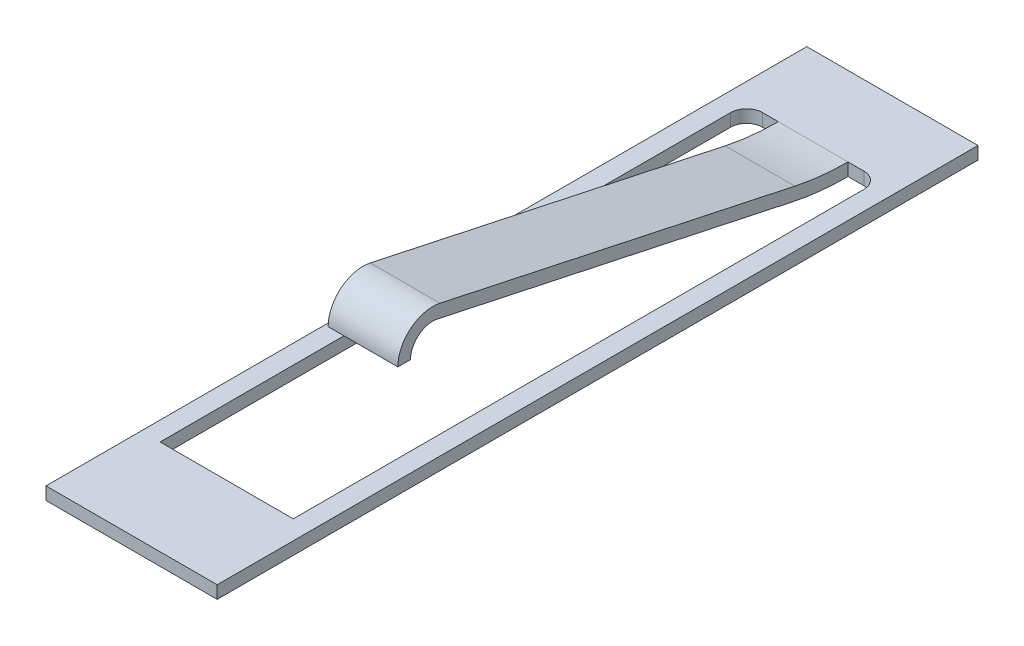
ISO-10303-21;
HEADER;
FILE_DESCRIPTION(('STEP AP214'),'2;1');
FILE_NAME('part.step','',(''),(''),'','','');
FILE_SCHEMA(('AUTOMOTIVE_DESIGN { 1 0 10303 214 1 1 1 1 }'));
ENDSEC;
DATA;
#1=APPLICATION_CONTEXT('core data for automotive mechanical design processes');
#2=APPLICATION_PROTOCOL_DEFINITION('international standard','automotive_design',2000,#1);
#3=PRODUCT_CONTEXT('',#1,'mechanical');
#4=PRODUCT('Part','Part','',(#3));
#5=PRODUCT_RELATED_PRODUCT_CATEGORY('part','',(#4));
#6=PRODUCT_DEFINITION_FORMATION('','',#4);
#7=PRODUCT_DEFINITION_CONTEXT('part definition',#1,'design');
#8=PRODUCT_DEFINITION('design','',#6,#7);
#9=PRODUCT_DEFINITION_SHAPE('','',#8);
#10=(LENGTH_UNIT() NAMED_UNIT(*) SI_UNIT(.MILLI.,.METRE.));
#11=(NAMED_UNIT(*) PLANE_ANGLE_UNIT() SI_UNIT($,.RADIAN.));
#12=(NAMED_UNIT(*) SI_UNIT($,.STERADIAN.) SOLID_ANGLE_UNIT());
#13=UNCERTAINTY_MEASURE_WITH_UNIT(LENGTH_MEASURE(1.E-05),#10,'distance_accuracy_value','');
#14=(GEOMETRIC_REPRESENTATION_CONTEXT(3) GLOBAL_UNCERTAINTY_ASSIGNED_CONTEXT((#13)) GLOBAL_UNIT_ASSIGNED_CONTEXT((#10,
#11,#12)) REPRESENTATION_CONTEXT('',''));
#15=CARTESIAN_POINT('',(0.,0.,0.));
#16=DIRECTION('',(0.,0.,1.));
#17=DIRECTION('',(1.,0.,0.));
#18=AXIS2_PLACEMENT_3D('',#15,#16,#17);
#19=CARTESIAN_POINT('',(-0.799999999999998,0.2,-4.75));
#20=DIRECTION('',(0.,0.,1.));
#21=DIRECTION('',(1.,0.,0.));
#22=AXIS2_PLACEMENT_3D('',#19,#20,#21);
#23=PLANE('',#22);
#24=DIRECTION('',(-1.,0.,0.));
#25=VECTOR('',#24,1.);
#26=CARTESIAN_POINT('',(-0.799999999999998,0.2,-4.75));
#27=LINE('',#26,#25);
#28=CARTESIAN_POINT('',(0.799999999999998,0.2,-4.75));
#29=VERTEX_POINT('',#28);
#30=CARTESIAN_POINT('',(0.550000000000001,0.2,-4.75));
#31=VERTEX_POINT('',#30);
#32=EDGE_CURVE('E208',#29,#31,#27,.T.);
#33=ORIENTED_EDGE('',*,*,#32,.T.);
#34=DIRECTION('',(0.,1.,0.));
#35=VECTOR('',#34,1.);
#36=CARTESIAN_POINT('',(0.550000000000001,0.,-4.75));
#37=LINE('',#36,#35);
#38=CARTESIAN_POINT('',(0.550000000000001,0.,-4.75));
#39=VERTEX_POINT('',#38);
#40=EDGE_CURVE('E502',#39,#31,#37,.T.);
#41=ORIENTED_EDGE('',*,*,#40,.F.);
#42=DIRECTION('',(-1.,0.,0.));
#43=VECTOR('',#42,1.);
#44=CARTESIAN_POINT('',(-0.799999999999998,0.,-4.75));
#45=LINE('',#44,#43);
#46=CARTESIAN_POINT('',(0.799999999999998,0.,-4.75));
#47=VERTEX_POINT('',#46);
#48=EDGE_CURVE('E198',#47,#39,#45,.T.);
#49=ORIENTED_EDGE('',*,*,#48,.F.);
#50=DIRECTION('',(0.,-1.,0.));
#51=VECTOR('',#50,1.);
#52=CARTESIAN_POINT('',(0.799999999999998,0.2,-4.75));
#53=LINE('',#52,#51);
#54=EDGE_CURVE('E227',#29,#47,#53,.T.);
#55=ORIENTED_EDGE('',*,*,#54,.F.);
#56=EDGE_LOOP('',(#33,#41,#49,#55));
#57=FACE_BOUND('',#56,.T.);
#58=ADVANCED_FACE('F34',(#57),#23,.T.);
#59=CARTESIAN_POINT('',(0.,0.2,0.));
#60=DIRECTION('',(0.,1.,0.));
#61=DIRECTION('',(0.,0.,1.));
#62=AXIS2_PLACEMENT_3D('',#59,#60,#61);
#63=PLANE('',#62);
#64=DIRECTION('',(0.,0.,1.));
#65=VECTOR('',#64,1.);
#66=CARTESIAN_POINT('',(-1.35,0.2,-6.));
#67=LINE('',#66,#65);
#68=CARTESIAN_POINT('',(-1.35,0.2,-6.));
#69=VERTEX_POINT('',#68);
#70=CARTESIAN_POINT('',(-1.35,0.2,6.));
#71=VERTEX_POINT('',#70);
#72=EDGE_CURVE('E239',#69,#71,#67,.T.);
#73=ORIENTED_EDGE('',*,*,#72,.T.);
#74=DIRECTION('',(1.,0.,0.));
#75=VECTOR('',#74,1.);
#76=CARTESIAN_POINT('',(-1.35,0.2,6.));
#77=LINE('',#76,#75);
#78=CARTESIAN_POINT('',(1.35000000000001,0.2,6.));
#79=VERTEX_POINT('',#78);
#80=EDGE_CURVE('E242',#71,#79,#77,.T.);
#81=ORIENTED_EDGE('',*,*,#80,.T.);
#82=DIRECTION('',(0.,0.,-1.));
#83=VECTOR('',#82,1.);
#84=CARTESIAN_POINT('',(1.35,0.2,-6.));
#85=LINE('',#84,#83);
#86=CARTESIAN_POINT('',(1.35,0.2,-6.));
#87=VERTEX_POINT('',#86);
#88=EDGE_CURVE('E245',#79,#87,#85,.T.);
#89=ORIENTED_EDGE('',*,*,#88,.T.);
#90=DIRECTION('',(-1.,0.,0.));
#91=VECTOR('',#90,1.);
#92=CARTESIAN_POINT('',(-1.35,0.2,-6.));
#93=LINE('',#92,#91);
#94=EDGE_CURVE('E247',#87,#69,#93,.T.);
#95=ORIENTED_EDGE('',*,*,#94,.T.);
#96=EDGE_LOOP('',(#73,#81,#89,#95));
#97=FACE_BOUND('',#96,.T.);
#98=DIRECTION('',(0.,0.,1.));
#99=VECTOR('',#98,1.);
#100=CARTESIAN_POINT('',(-1.05,0.2,-4.5));
#101=LINE('',#100,#99);
#102=CARTESIAN_POINT('',(-1.05,0.2,-4.5));
#103=VERTEX_POINT('',#102);
#104=CARTESIAN_POINT('',(-1.05,0.2,4.5));
#105=VERTEX_POINT('',#104);
#106=EDGE_CURVE('E197',#103,#105,#101,.T.);
#107=ORIENTED_EDGE('',*,*,#106,.F.);
#108=CARTESIAN_POINT('',(-0.799999999999998,0.2,-4.5));
#109=DIRECTION('',(0.,1.,0.));
#110=DIRECTION('',(0.,0.,-1.));
#111=AXIS2_PLACEMENT_3D('',#108,#109,#110);
#112=CIRCLE('',#111,0.249999999999999);
#113=CARTESIAN_POINT('',(-0.799999999999998,0.2,-4.75));
#114=VERTEX_POINT('',#113);
#115=EDGE_CURVE('E195',#114,#103,#112,.T.);
#116=ORIENTED_EDGE('',*,*,#115,.F.);
#117=CARTESIAN_POINT('',(-0.549999999999999,0.2,-4.75));
#118=VERTEX_POINT('',#117);
#119=EDGE_CURVE('E207',#118,#114,#27,.T.);
#120=ORIENTED_EDGE('',*,*,#119,.F.);
#121=DIRECTION('',(-1.,0.,0.));
#122=VECTOR('',#121,1.);
#123=CARTESIAN_POINT('',(0.550000000000001,0.2,-4.75));
#124=LINE('',#123,#122);
#125=EDGE_CURVE('E56',#31,#118,#124,.T.);
#126=ORIENTED_EDGE('',*,*,#125,.F.);
#127=ORIENTED_EDGE('',*,*,#32,.F.);
#128=CARTESIAN_POINT('',(0.799999999999998,0.2,-4.5));
#129=DIRECTION('',(0.,1.,0.));
#130=DIRECTION('',(0.,0.,1.));
#131=AXIS2_PLACEMENT_3D('',#128,#129,#130);
#132=CIRCLE('',#131,0.249999999999999);
#133=CARTESIAN_POINT('',(1.05,0.2,-4.5));
#134=VERTEX_POINT('',#133);
#135=EDGE_CURVE('E204',#134,#29,#132,.T.);
#136=ORIENTED_EDGE('',*,*,#135,.F.);
#137=DIRECTION('',(0.,0.,-1.));
#138=VECTOR('',#137,1.);
#139=CARTESIAN_POINT('',(1.05,0.2,4.5));
#140=LINE('',#139,#138);
#141=CARTESIAN_POINT('',(1.05,0.2,4.5));
#142=VERTEX_POINT('',#141);
#143=EDGE_CURVE('E202',#142,#134,#140,.T.);
#144=ORIENTED_EDGE('',*,*,#143,.F.);
#145=DIRECTION('',(1.,0.,0.));
#146=VECTOR('',#145,1.);
#147=CARTESIAN_POINT('',(-1.05,0.2,4.5));
#148=LINE('',#147,#146);
#149=EDGE_CURVE('E200',#105,#142,#148,.T.);
#150=ORIENTED_EDGE('',*,*,#149,.F.);
#151=EDGE_LOOP('',(#107,#116,#120,#126,#127,#136,#144,#150));
#152=FACE_BOUND('',#151,.T.);
#153=ADVANCED_FACE('F282',(#97,#152),#63,.T.);
#154=CARTESIAN_POINT('',(0.,0.,0.));
#155=DIRECTION('',(0.,1.,0.));
#156=DIRECTION('',(0.,0.,1.));
#157=AXIS2_PLACEMENT_3D('',#154,#155,#156);
#158=PLANE('',#157);
#159=DIRECTION('',(0.,0.,1.));
#160=VECTOR('',#159,1.);
#161=CARTESIAN_POINT('',(-1.35,0.,-6.));
#162=LINE('',#161,#160);
#163=CARTESIAN_POINT('',(-1.35,0.,-6.));
#164=VERTEX_POINT('',#163);
#165=CARTESIAN_POINT('',(-1.35,0.,6.));
#166=VERTEX_POINT('',#165);
#167=EDGE_CURVE('E238',#164,#166,#162,.T.);
#168=ORIENTED_EDGE('',*,*,#167,.F.);
#169=DIRECTION('',(-1.,0.,0.));
#170=VECTOR('',#169,1.);
#171=CARTESIAN_POINT('',(-1.35,0.,-6.));
#172=LINE('',#171,#170);
#173=CARTESIAN_POINT('',(1.35,0.,-6.));
#174=VERTEX_POINT('',#173);
#175=EDGE_CURVE('E243',#174,#164,#172,.T.);
#176=ORIENTED_EDGE('',*,*,#175,.F.);
#177=DIRECTION('',(0.,0.,-1.));
#178=VECTOR('',#177,1.);
#179=CARTESIAN_POINT('',(1.35,0.,-6.));
#180=LINE('',#179,#178);
#181=CARTESIAN_POINT('',(1.35000000000001,0.,6.));
#182=VERTEX_POINT('',#181);
#183=EDGE_CURVE('E254',#182,#174,#180,.T.);
#184=ORIENTED_EDGE('',*,*,#183,.F.);
#185=DIRECTION('',(1.,0.,0.));
#186=VECTOR('',#185,1.);
#187=CARTESIAN_POINT('',(-1.35,0.,6.));
#188=LINE('',#187,#186);
#189=EDGE_CURVE('E252',#166,#182,#188,.T.);
#190=ORIENTED_EDGE('',*,*,#189,.F.);
#191=EDGE_LOOP('',(#168,#176,#184,#190));
#192=FACE_BOUND('',#191,.T.);
#193=CARTESIAN_POINT('',(-0.799999999999998,0.,-4.5));
#194=DIRECTION('',(0.,1.,0.));
#195=DIRECTION('',(0.,0.,-1.));
#196=AXIS2_PLACEMENT_3D('',#193,#194,#195);
#197=CIRCLE('',#196,0.249999999999999);
#198=CARTESIAN_POINT('',(-0.799999999999998,0.,-4.75));
#199=VERTEX_POINT('',#198);
#200=CARTESIAN_POINT('',(-1.05,0.,-4.5));
#201=VERTEX_POINT('',#200);
#202=EDGE_CURVE('E186',#199,#201,#197,.T.);
#203=ORIENTED_EDGE('',*,*,#202,.T.);
#204=DIRECTION('',(0.,0.,1.));
#205=VECTOR('',#204,1.);
#206=CARTESIAN_POINT('',(-1.05,0.,-4.5));
#207=LINE('',#206,#205);
#208=CARTESIAN_POINT('',(-1.05,0.,4.5));
#209=VERTEX_POINT('',#208);
#210=EDGE_CURVE('E189',#201,#209,#207,.T.);
#211=ORIENTED_EDGE('',*,*,#210,.T.);
#212=DIRECTION('',(1.,0.,0.));
#213=VECTOR('',#212,1.);
#214=CARTESIAN_POINT('',(-1.05,0.,4.5));
#215=LINE('',#214,#213);
#216=CARTESIAN_POINT('',(1.05,0.,4.5));
#217=VERTEX_POINT('',#216);
#218=EDGE_CURVE('E213',#209,#217,#215,.T.);
#219=ORIENTED_EDGE('',*,*,#218,.T.);
#220=DIRECTION('',(0.,0.,-1.));
#221=VECTOR('',#220,1.);
#222=CARTESIAN_POINT('',(1.05,0.,4.5));
#223=LINE('',#222,#221);
#224=CARTESIAN_POINT('',(1.05,0.,-4.5));
#225=VERTEX_POINT('',#224);
#226=EDGE_CURVE('E216',#217,#225,#223,.T.);
#227=ORIENTED_EDGE('',*,*,#226,.T.);
#228=CARTESIAN_POINT('',(0.799999999999998,0.,-4.5));
#229=DIRECTION('',(0.,1.,0.));
#230=DIRECTION('',(0.,0.,1.));
#231=AXIS2_PLACEMENT_3D('',#228,#229,#230);
#232=CIRCLE('',#231,0.249999999999999);
#233=EDGE_CURVE('E219',#225,#47,#232,.T.);
#234=ORIENTED_EDGE('',*,*,#233,.T.);
#235=ORIENTED_EDGE('',*,*,#48,.T.);
#236=DIRECTION('',(-1.,0.,0.));
#237=VECTOR('',#236,1.);
#238=CARTESIAN_POINT('',(0.550000000000001,0.,-4.75));
#239=LINE('',#238,#237);
#240=CARTESIAN_POINT('',(-0.549999999999999,0.,-4.75));
#241=VERTEX_POINT('',#240);
#242=EDGE_CURVE('E486',#39,#241,#239,.T.);
#243=ORIENTED_EDGE('',*,*,#242,.T.);
#244=EDGE_CURVE('E222',#241,#199,#45,.T.);
#245=ORIENTED_EDGE('',*,*,#244,.T.);
#246=EDGE_LOOP('',(#203,#211,#219,#227,#234,#235,#243,#245));
#247=FACE_BOUND('',#246,.T.);
#248=ADVANCED_FACE('F272',(#192,#247),#158,.F.);
#249=CARTESIAN_POINT('',(-1.35,0.2,-6.));
#250=DIRECTION('',(1.,0.,0.));
#251=DIRECTION('',(0.,0.,-1.));
#252=AXIS2_PLACEMENT_3D('',#249,#250,#251);
#253=PLANE('',#252);
#254=ORIENTED_EDGE('',*,*,#167,.T.);
#255=DIRECTION('',(0.,-1.,0.));
#256=VECTOR('',#255,1.);
#257=CARTESIAN_POINT('',(-1.35,0.2,6.));
#258=LINE('',#257,#256);
#259=EDGE_CURVE('E11',#71,#166,#258,.T.);
#260=ORIENTED_EDGE('',*,*,#259,.F.);
#261=ORIENTED_EDGE('',*,*,#72,.F.);
#262=DIRECTION('',(0.,-1.,0.));
#263=VECTOR('',#262,1.);
#264=CARTESIAN_POINT('',(-1.35,0.2,-6.));
#265=LINE('',#264,#263);
#266=EDGE_CURVE('E249',#69,#164,#265,.T.);
#267=ORIENTED_EDGE('',*,*,#266,.T.);
#268=EDGE_LOOP('',(#254,#260,#261,#267));
#269=FACE_BOUND('',#268,.T.);
#270=ADVANCED_FACE('F36',(#269),#253,.F.);
#271=CARTESIAN_POINT('',(-1.35,0.2,6.));
#272=DIRECTION('',(0.,0.,-1.));
#273=DIRECTION('',(-1.,0.,0.));
#274=AXIS2_PLACEMENT_3D('',#271,#272,#273);
#275=PLANE('',#274);
#276=ORIENTED_EDGE('',*,*,#189,.T.);
#277=DIRECTION('',(0.,-1.,0.));
#278=VECTOR('',#277,1.);
#279=CARTESIAN_POINT('',(1.35000000000001,0.2,6.));
#280=LINE('',#279,#278);
#281=EDGE_CURVE('E42',#79,#182,#280,.T.);
#282=ORIENTED_EDGE('',*,*,#281,.F.);
#283=ORIENTED_EDGE('',*,*,#80,.F.);
#284=ORIENTED_EDGE('',*,*,#259,.T.);
#285=EDGE_LOOP('',(#276,#282,#283,#284));
#286=FACE_BOUND('',#285,.T.);
#287=ADVANCED_FACE('F283',(#286),#275,.F.);
#288=CARTESIAN_POINT('',(1.35,0.2,-6.));
#289=DIRECTION('',(-1.,0.,0.));
#290=DIRECTION('',(0.,0.,1.));
#291=AXIS2_PLACEMENT_3D('',#288,#289,#290);
#292=PLANE('',#291);
#293=ORIENTED_EDGE('',*,*,#183,.T.);
#294=DIRECTION('',(0.,-1.,0.));
#295=VECTOR('',#294,1.);
#296=CARTESIAN_POINT('',(1.35,0.2,-6.));
#297=LINE('',#296,#295);
#298=EDGE_CURVE('E259',#87,#174,#297,.T.);
#299=ORIENTED_EDGE('',*,*,#298,.F.);
#300=ORIENTED_EDGE('',*,*,#88,.F.);
#301=ORIENTED_EDGE('',*,*,#281,.T.);
#302=EDGE_LOOP('',(#293,#299,#300,#301));
#303=FACE_BOUND('',#302,.T.);
#304=ADVANCED_FACE('F266',(#303),#292,.F.);
#305=CARTESIAN_POINT('',(-1.35,0.2,-6.));
#306=DIRECTION('',(0.,0.,1.));
#307=DIRECTION('',(1.,0.,0.));
#308=AXIS2_PLACEMENT_3D('',#305,#306,#307);
#309=PLANE('',#308);
#310=ORIENTED_EDGE('',*,*,#175,.T.);
#311=ORIENTED_EDGE('',*,*,#266,.F.);
#312=ORIENTED_EDGE('',*,*,#94,.F.);
#313=ORIENTED_EDGE('',*,*,#298,.T.);
#314=EDGE_LOOP('',(#310,#311,#312,#313));
#315=FACE_BOUND('',#314,.T.);
#316=ADVANCED_FACE('F276',(#315),#309,.F.);
#317=CARTESIAN_POINT('',(-0.799999999999998,0.2,-4.5));
#318=DIRECTION('',(0.,-1.,0.));
#319=DIRECTION('',(0.,0.,-1.));
#320=AXIS2_PLACEMENT_3D('',#317,#318,#319);
#321=CYLINDRICAL_SURFACE('',#320,0.249999999999999);
#322=ORIENTED_EDGE('',*,*,#202,.F.);
#323=DIRECTION('',(0.,-1.,0.));
#324=VECTOR('',#323,1.);
#325=CARTESIAN_POINT('',(-0.799999999999998,0.2,-4.75));
#326=LINE('',#325,#324);
#327=EDGE_CURVE('E209',#114,#199,#326,.T.);
#328=ORIENTED_EDGE('',*,*,#327,.F.);
#329=ORIENTED_EDGE('',*,*,#115,.T.);
#330=DIRECTION('',(0.,-1.,0.));
#331=VECTOR('',#330,1.);
#332=CARTESIAN_POINT('',(-1.05,0.2,-4.5));
#333=LINE('',#332,#331);
#334=EDGE_CURVE('E235',#103,#201,#333,.T.);
#335=ORIENTED_EDGE('',*,*,#334,.T.);
#336=EDGE_LOOP('',(#322,#328,#329,#335));
#337=FACE_BOUND('',#336,.T.);
#338=ADVANCED_FACE('F322',(#337),#321,.F.);
#339=CARTESIAN_POINT('',(-1.05,0.2,-4.5));
#340=DIRECTION('',(1.,0.,0.));
#341=DIRECTION('',(0.,0.,-1.));
#342=AXIS2_PLACEMENT_3D('',#339,#340,#341);
#343=PLANE('',#342);
#344=ORIENTED_EDGE('',*,*,#210,.F.);
#345=ORIENTED_EDGE('',*,*,#334,.F.);
#346=ORIENTED_EDGE('',*,*,#106,.T.);
#347=DIRECTION('',(0.,-1.,0.));
#348=VECTOR('',#347,1.);
#349=CARTESIAN_POINT('',(-1.05,0.2,4.5));
#350=LINE('',#349,#348);
#351=EDGE_CURVE('E233',#105,#209,#350,.T.);
#352=ORIENTED_EDGE('',*,*,#351,.T.);
#353=EDGE_LOOP('',(#344,#345,#346,#352));
#354=FACE_BOUND('',#353,.T.);
#355=ADVANCED_FACE('F318',(#354),#343,.T.);
#356=CARTESIAN_POINT('',(-1.05,0.2,4.5));
#357=DIRECTION('',(0.,0.,-1.));
#358=DIRECTION('',(-1.,0.,0.));
#359=AXIS2_PLACEMENT_3D('',#356,#357,#358);
#360=PLANE('',#359);
#361=ORIENTED_EDGE('',*,*,#218,.F.);
#362=ORIENTED_EDGE('',*,*,#351,.F.);
#363=ORIENTED_EDGE('',*,*,#149,.T.);
#364=DIRECTION('',(0.,-1.,0.));
#365=VECTOR('',#364,1.);
#366=CARTESIAN_POINT('',(1.05,0.2,4.5));
#367=LINE('',#366,#365);
#368=EDGE_CURVE('E231',#142,#217,#367,.T.);
#369=ORIENTED_EDGE('',*,*,#368,.T.);
#370=EDGE_LOOP('',(#361,#362,#363,#369));
#371=FACE_BOUND('',#370,.T.);
#372=ADVANCED_FACE('F311',(#371),#360,.T.);
#373=CARTESIAN_POINT('',(1.05,0.2,4.5));
#374=DIRECTION('',(-1.,0.,0.));
#375=DIRECTION('',(0.,0.,1.));
#376=AXIS2_PLACEMENT_3D('',#373,#374,#375);
#377=PLANE('',#376);
#378=ORIENTED_EDGE('',*,*,#226,.F.);
#379=ORIENTED_EDGE('',*,*,#368,.F.);
#380=ORIENTED_EDGE('',*,*,#143,.T.);
#381=DIRECTION('',(0.,-1.,0.));
#382=VECTOR('',#381,1.);
#383=CARTESIAN_POINT('',(1.05,0.2,-4.5));
#384=LINE('',#383,#382);
#385=EDGE_CURVE('E229',#134,#225,#384,.T.);
#386=ORIENTED_EDGE('',*,*,#385,.T.);
#387=EDGE_LOOP('',(#378,#379,#380,#386));
#388=FACE_BOUND('',#387,.T.);
#389=ADVANCED_FACE('F306',(#388),#377,.T.);
#390=CARTESIAN_POINT('',(0.799999999999998,0.2,-4.5));
#391=DIRECTION('',(0.,-1.,0.));
#392=DIRECTION('',(0.,0.,-1.));
#393=AXIS2_PLACEMENT_3D('',#390,#391,#392);
#394=CYLINDRICAL_SURFACE('',#393,0.249999999999999);
#395=ORIENTED_EDGE('',*,*,#233,.F.);
#396=ORIENTED_EDGE('',*,*,#385,.F.);
#397=ORIENTED_EDGE('',*,*,#135,.T.);
#398=ORIENTED_EDGE('',*,*,#54,.T.);
#399=EDGE_LOOP('',(#395,#396,#397,#398));
#400=FACE_BOUND('',#399,.T.);
#401=ADVANCED_FACE('F301',(#400),#394,.F.);
#402=DIRECTION('',(0.,1.,0.));
#403=VECTOR('',#402,1.);
#404=CARTESIAN_POINT('',(-0.549999999999999,0.,-4.75));
#405=LINE('',#404,#403);
#406=EDGE_CURVE('E49',#241,#118,#405,.T.);
#407=ORIENTED_EDGE('',*,*,#406,.T.);
#408=ORIENTED_EDGE('',*,*,#119,.T.);
#409=ORIENTED_EDGE('',*,*,#327,.T.);
#410=ORIENTED_EDGE('',*,*,#244,.F.);
#411=EDGE_LOOP('',(#407,#408,#409,#410));
#412=FACE_BOUND('',#411,.T.);
#413=ADVANCED_FACE('F293',(#412),#23,.T.);
#414=CARTESIAN_POINT('',(0.550000000000001,0.95,1.8));
#415=DIRECTION('',(-1.,0.,0.));
#416=DIRECTION('',(0.,0.,1.));
#417=AXIS2_PLACEMENT_3D('',#414,#415,#416);
#418=CYLINDRICAL_SURFACE('',#417,0.55);
#419=CARTESIAN_POINT('',(-0.549999999999999,0.95,1.8));
#420=DIRECTION('',(1.,0.,0.));
#421=DIRECTION('',(0.,0.,1.));
#422=AXIS2_PLACEMENT_3D('',#419,#420,#421);
#423=CIRCLE('',#422,0.55);
#424=CARTESIAN_POINT('',(-0.549999999999999,1.48779683125834,1.68478468726559));
#425=VERTEX_POINT('',#424);
#426=CARTESIAN_POINT('',(-0.549999999999999,0.95,2.35));
#427=VERTEX_POINT('',#426);
#428=EDGE_CURVE('E185',#425,#427,#423,.T.);
#429=ORIENTED_EDGE('',*,*,#428,.T.);
#430=DIRECTION('',(-1.,0.,0.));
#431=VECTOR('',#430,1.);
#432=CARTESIAN_POINT('',(0.550000000000001,0.95,2.35));
#433=LINE('',#432,#431);
#434=CARTESIAN_POINT('',(0.550000000000001,0.95,2.35));
#435=VERTEX_POINT('',#434);
#436=EDGE_CURVE('E165',#435,#427,#433,.T.);
#437=ORIENTED_EDGE('',*,*,#436,.F.);
#438=CARTESIAN_POINT('',(0.550000000000001,0.95,1.8));
#439=DIRECTION('',(1.,0.,0.));
#440=DIRECTION('',(0.,0.,1.));
#441=AXIS2_PLACEMENT_3D('',#438,#439,#440);
#442=CIRCLE('',#441,0.55);
#443=CARTESIAN_POINT('',(0.550000000000001,1.48779683125834,1.68478468726559));
#444=VERTEX_POINT('',#443);
#445=EDGE_CURVE('E172',#444,#435,#442,.T.);
#446=ORIENTED_EDGE('',*,*,#445,.F.);
#447=DIRECTION('',(-1.,0.,0.));
#448=VECTOR('',#447,1.);
#449=CARTESIAN_POINT('',(0.550000000000001,1.48779683125834,1.68478468726559));
#450=LINE('',#449,#448);
#451=EDGE_CURVE('E480',#444,#425,#450,.T.);
#452=ORIENTED_EDGE('',*,*,#451,.T.);
#453=EDGE_LOOP('',(#429,#437,#446,#452));
#454=FACE_BOUND('',#453,.T.);
#455=ADVANCED_FACE('F183',(#454),#418,.T.);
#456=CARTESIAN_POINT('',(0.550000000000001,0.95,2.15));
#457=DIRECTION('',(0.,1.,0.));
#458=DIRECTION('',(0.,0.,1.));
#459=AXIS2_PLACEMENT_3D('',#456,#457,#458);
#460=PLANE('',#459);
#461=DIRECTION('',(0.,0.,-1.));
#462=VECTOR('',#461,1.);
#463=CARTESIAN_POINT('',(-0.549999999999999,0.95,2.15));
#464=LINE('',#463,#462);
#465=CARTESIAN_POINT('',(-0.549999999999999,0.95,2.15));
#466=VERTEX_POINT('',#465);
#467=EDGE_CURVE('E463',#427,#466,#464,.T.);
#468=ORIENTED_EDGE('',*,*,#467,.T.);
#469=DIRECTION('',(-1.,0.,0.));
#470=VECTOR('',#469,1.);
#471=CARTESIAN_POINT('',(0.550000000000001,0.95,2.15));
#472=LINE('',#471,#470);
#473=CARTESIAN_POINT('',(0.550000000000001,0.95,2.15));
#474=VERTEX_POINT('',#473);
#475=EDGE_CURVE('E168',#474,#466,#472,.T.);
#476=ORIENTED_EDGE('',*,*,#475,.F.);
#477=DIRECTION('',(0.,0.,-1.));
#478=VECTOR('',#477,1.);
#479=CARTESIAN_POINT('',(0.550000000000001,0.95,2.15));
#480=LINE('',#479,#478);
#481=EDGE_CURVE('E161',#435,#474,#480,.T.);
#482=ORIENTED_EDGE('',*,*,#481,.F.);
#483=ORIENTED_EDGE('',*,*,#436,.T.);
#484=EDGE_LOOP('',(#468,#476,#482,#483));
#485=FACE_BOUND('',#484,.T.);
#486=ADVANCED_FACE('F163',(#485),#460,.F.);
#487=CARTESIAN_POINT('',(0.550000000000001,0.95,1.8));
#488=DIRECTION('',(-1.,0.,0.));
#489=DIRECTION('',(0.,0.,1.));
#490=AXIS2_PLACEMENT_3D('',#487,#488,#489);
#491=CYLINDRICAL_SURFACE('',#490,0.35);
#492=CARTESIAN_POINT('',(-0.549999999999999,0.95,1.8));
#493=DIRECTION('',(-1.,0.,0.));
#494=DIRECTION('',(0.,0.,1.));
#495=AXIS2_PLACEMENT_3D('',#492,#493,#494);
#496=CIRCLE('',#495,0.35);
#497=CARTESIAN_POINT('',(-0.549999999999999,1.2922343471644,1.72668116462356));
#498=VERTEX_POINT('',#497);
#499=EDGE_CURVE('E465',#466,#498,#496,.T.);
#500=ORIENTED_EDGE('',*,*,#499,.T.);
#501=DIRECTION('',(-1.,0.,0.));
#502=VECTOR('',#501,1.);
#503=CARTESIAN_POINT('',(0.550000000000001,1.2922343471644,1.72668116462356));
#504=LINE('',#503,#502);
#505=CARTESIAN_POINT('',(0.550000000000001,1.2922343471644,1.72668116462356));
#506=VERTEX_POINT('',#505);
#507=EDGE_CURVE('E191',#506,#498,#504,.T.);
#508=ORIENTED_EDGE('',*,*,#507,.F.);
#509=CARTESIAN_POINT('',(0.550000000000001,0.95,1.8));
#510=DIRECTION('',(-1.,0.,0.));
#511=DIRECTION('',(0.,0.,1.));
#512=AXIS2_PLACEMENT_3D('',#509,#510,#511);
#513=CIRCLE('',#512,0.35);
#514=EDGE_CURVE('E171',#474,#506,#513,.T.);
#515=ORIENTED_EDGE('',*,*,#514,.F.);
#516=ORIENTED_EDGE('',*,*,#475,.T.);
#517=EDGE_LOOP('',(#500,#508,#515,#516));
#518=FACE_BOUND('',#517,.T.);
#519=ADVANCED_FACE('F389',(#518),#491,.F.);
#520=CARTESIAN_POINT('',(0.550000000000001,1.2922343471644,1.72668116462356));
#521=DIRECTION('',(0.,0.97781242046971,-0.209482386789839));
#522=DIRECTION('',(0.,0.209482386789839,0.97781242046971));
#523=AXIS2_PLACEMENT_3D('',#520,#521,#522);
#524=PLANE('',#523);
#525=DIRECTION('',(0.,-0.209482386789839,-0.97781242046971));
#526=VECTOR('',#525,1.);
#527=CARTESIAN_POINT('',(-0.549999999999999,1.2922343471644,1.72668116462356));
#528=LINE('',#527,#526);
#529=CARTESIAN_POINT('',(-0.549999999999999,0.0931878340272195,-3.87017397548268));
#530=VERTEX_POINT('',#529);
#531=EDGE_CURVE('E471',#498,#530,#528,.T.);
#532=ORIENTED_EDGE('',*,*,#531,.T.);
#533=DIRECTION('',(-1.,0.,0.));
#534=VECTOR('',#533,1.);
#535=CARTESIAN_POINT('',(0.550000000000001,0.0931878340272195,-3.87017397548268));
#536=LINE('',#535,#534);
#537=CARTESIAN_POINT('',(0.550000000000001,0.0931878340272195,-3.87017397548268));
#538=VERTEX_POINT('',#537);
#539=EDGE_CURVE('E488',#538,#530,#536,.T.);
#540=ORIENTED_EDGE('',*,*,#539,.F.);
#541=DIRECTION('',(0.,-0.209482386789839,-0.97781242046971));
#542=VECTOR('',#541,1.);
#543=CARTESIAN_POINT('',(0.550000000000001,1.2922343471644,1.72668116462356));
#544=LINE('',#543,#542);
#545=EDGE_CURVE('E495',#506,#538,#544,.T.);
#546=ORIENTED_EDGE('',*,*,#545,.F.);
#547=ORIENTED_EDGE('',*,*,#507,.T.);
#548=EDGE_LOOP('',(#532,#540,#546,#547));
#549=FACE_BOUND('',#548,.T.);
#550=ADVANCED_FACE('F398',(#549),#524,.F.);
#551=CARTESIAN_POINT('',(0.550000000000001,4.2,-4.75));
#552=DIRECTION('',(-1.,0.,0.));
#553=DIRECTION('',(0.,0.,1.));
#554=AXIS2_PLACEMENT_3D('',#551,#552,#553);
#555=CYLINDRICAL_SURFACE('',#554,4.2);
#556=CARTESIAN_POINT('',(-0.549999999999999,4.2,-4.75));
#557=DIRECTION('',(1.,0.,0.));
#558=DIRECTION('',(0.,0.,1.));
#559=AXIS2_PLACEMENT_3D('',#556,#557,#558);
#560=CIRCLE('',#559,4.2);
#561=EDGE_CURVE('E473',#530,#241,#560,.T.);
#562=ORIENTED_EDGE('',*,*,#561,.T.);
#563=ORIENTED_EDGE('',*,*,#242,.F.);
#564=CARTESIAN_POINT('',(0.550000000000001,4.2,-4.75));
#565=DIRECTION('',(1.,0.,0.));
#566=DIRECTION('',(0.,0.,1.));
#567=AXIS2_PLACEMENT_3D('',#564,#565,#566);
#568=CIRCLE('',#567,4.2);
#569=EDGE_CURVE('E500',#538,#39,#568,.T.);
#570=ORIENTED_EDGE('',*,*,#569,.F.);
#571=ORIENTED_EDGE('',*,*,#539,.T.);
#572=EDGE_LOOP('',(#562,#563,#570,#571));
#573=FACE_BOUND('',#572,.T.);
#574=ADVANCED_FACE('F408',(#573),#555,.T.);
#575=CARTESIAN_POINT('',(0.550000000000001,4.2,-4.75));
#576=DIRECTION('',(-1.,0.,0.));
#577=DIRECTION('',(0.,0.,1.));
#578=AXIS2_PLACEMENT_3D('',#575,#576,#577);
#579=CYLINDRICAL_SURFACE('',#578,4.);
#580=CARTESIAN_POINT('',(-0.549999999999999,4.2,-4.75));
#581=DIRECTION('',(-1.,0.,0.));
#582=DIRECTION('',(0.,0.,1.));
#583=AXIS2_PLACEMENT_3D('',#580,#581,#582);
#584=CIRCLE('',#583,4.);
#585=CARTESIAN_POINT('',(-0.549999999999999,0.288750318121161,-3.91207045284065));
#586=VERTEX_POINT('',#585);
#587=EDGE_CURVE('E477',#118,#586,#584,.T.);
#588=ORIENTED_EDGE('',*,*,#587,.T.);
#589=DIRECTION('',(-1.,0.,0.));
#590=VECTOR('',#589,1.);
#591=CARTESIAN_POINT('',(0.550000000000001,0.288750318121161,-3.91207045284065));
#592=LINE('',#591,#590);
#593=CARTESIAN_POINT('',(0.550000000000001,0.288750318121161,-3.91207045284065));
#594=VERTEX_POINT('',#593);
#595=EDGE_CURVE('E482',#594,#586,#592,.T.);
#596=ORIENTED_EDGE('',*,*,#595,.F.);
#597=CARTESIAN_POINT('',(0.550000000000001,4.2,-4.75));
#598=DIRECTION('',(-1.,0.,0.));
#599=DIRECTION('',(0.,0.,1.));
#600=AXIS2_PLACEMENT_3D('',#597,#598,#599);
#601=CIRCLE('',#600,4.);
#602=EDGE_CURVE('E504',#31,#594,#601,.T.);
#603=ORIENTED_EDGE('',*,*,#602,.F.);
#604=ORIENTED_EDGE('',*,*,#125,.T.);
#605=EDGE_LOOP('',(#588,#596,#603,#604));
#606=FACE_BOUND('',#605,.T.);
#607=ADVANCED_FACE('F418',(#606),#579,.F.);
#608=CARTESIAN_POINT('',(0.550000000000001,1.48779683125834,1.68478468726559));
#609=DIRECTION('',(0.,-0.97781242046971,0.209482386789838));
#610=DIRECTION('',(0.,-0.209482386789838,-0.97781242046971));
#611=AXIS2_PLACEMENT_3D('',#608,#609,#610);
#612=PLANE('',#611);
#613=DIRECTION('',(0.,0.209482386789838,0.97781242046971));
#614=VECTOR('',#613,1.);
#615=CARTESIAN_POINT('',(-0.549999999999999,1.48779683125834,1.68478468726559));
#616=LINE('',#615,#614);
#617=EDGE_CURVE('E181',#586,#425,#616,.T.);
#618=ORIENTED_EDGE('',*,*,#617,.T.);
#619=ORIENTED_EDGE('',*,*,#451,.F.);
#620=DIRECTION('',(0.,0.209482386789838,0.97781242046971));
#621=VECTOR('',#620,1.);
#622=CARTESIAN_POINT('',(0.550000000000001,1.48779683125834,1.68478468726559));
#623=LINE('',#622,#621);
#624=EDGE_CURVE('E177',#594,#444,#623,.T.);
#625=ORIENTED_EDGE('',*,*,#624,.F.);
#626=ORIENTED_EDGE('',*,*,#595,.T.);
#627=EDGE_LOOP('',(#618,#619,#625,#626));
#628=FACE_BOUND('',#627,.T.);
#629=ADVANCED_FACE('F428',(#628),#612,.F.);
#630=CARTESIAN_POINT('',(0.550000000000001,0.95,1.8));
#631=DIRECTION('',(-1.,0.,0.));
#632=DIRECTION('',(0.,0.,1.));
#633=AXIS2_PLACEMENT_3D('',#630,#631,#632);
#634=PLANE('',#633);
#635=ORIENTED_EDGE('',*,*,#445,.T.);
#636=ORIENTED_EDGE('',*,*,#481,.T.);
#637=ORIENTED_EDGE('',*,*,#514,.T.);
#638=ORIENTED_EDGE('',*,*,#545,.T.);
#639=ORIENTED_EDGE('',*,*,#569,.T.);
#640=ORIENTED_EDGE('',*,*,#40,.T.);
#641=ORIENTED_EDGE('',*,*,#602,.T.);
#642=ORIENTED_EDGE('',*,*,#624,.T.);
#643=EDGE_LOOP('',(#635,#636,#637,#638,#639,#640,#641,#642));
#644=FACE_BOUND('',#643,.T.);
#645=ADVANCED_FACE('F175',(#644),#634,.F.);
#646=CARTESIAN_POINT('',(-0.549999999999999,0.95,1.8));
#647=DIRECTION('',(-1.,0.,0.));
#648=DIRECTION('',(0.,0.,1.));
#649=AXIS2_PLACEMENT_3D('',#646,#647,#648);
#650=PLANE('',#649);
#651=ORIENTED_EDGE('',*,*,#428,.F.);
#652=ORIENTED_EDGE('',*,*,#617,.F.);
#653=ORIENTED_EDGE('',*,*,#587,.F.);
#654=ORIENTED_EDGE('',*,*,#406,.F.);
#655=ORIENTED_EDGE('',*,*,#561,.F.);
#656=ORIENTED_EDGE('',*,*,#531,.F.);
#657=ORIENTED_EDGE('',*,*,#499,.F.);
#658=ORIENTED_EDGE('',*,*,#467,.F.);
#659=EDGE_LOOP('',(#651,#652,#653,#654,#655,#656,#657,#658));
#660=FACE_BOUND('',#659,.T.);
#661=ADVANCED_FACE('F447',(#660),#650,.T.);
#662=CLOSED_SHELL('',(#58,#153,#248,#270,#287,#304,#316,#338,#355,#372,#389,#401,#413,#455,#486,
#519,#550,#574,#607,#629,#645,#661));
#663=MANIFOLD_SOLID_BREP('B2',#662);
#664=ADVANCED_BREP_SHAPE_REPRESENTATION('',(#18,#663),#14);
#665=SHAPE_DEFINITION_REPRESENTATION(#9,#664);
ENDSEC;
END-ISO-10303-21;
